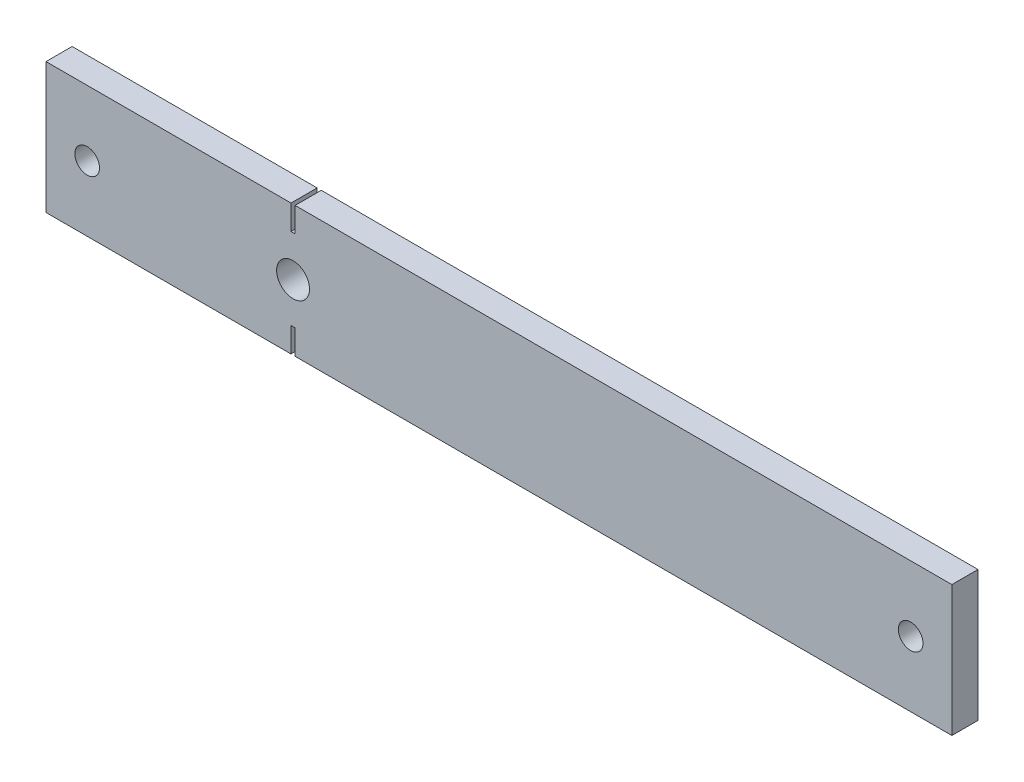
ISO-10303-21;
HEADER;
FILE_DESCRIPTION(('STEP AP214'),'2;1');
FILE_NAME('part.step','',(''),(''),'','','');
FILE_SCHEMA(('AUTOMOTIVE_DESIGN { 1 0 10303 214 1 1 1 1 }'));
ENDSEC;
DATA;
#1=APPLICATION_CONTEXT('core data for automotive mechanical design processes');
#2=APPLICATION_PROTOCOL_DEFINITION('international standard','automotive_design',2000,#1);
#3=PRODUCT_CONTEXT('',#1,'mechanical');
#4=PRODUCT('Part','Part','',(#3));
#5=PRODUCT_RELATED_PRODUCT_CATEGORY('part','',(#4));
#6=PRODUCT_DEFINITION_FORMATION('','',#4);
#7=PRODUCT_DEFINITION_CONTEXT('part definition',#1,'design');
#8=PRODUCT_DEFINITION('design','',#6,#7);
#9=PRODUCT_DEFINITION_SHAPE('','',#8);
#10=(LENGTH_UNIT() NAMED_UNIT(*) SI_UNIT(.MILLI.,.METRE.));
#11=(NAMED_UNIT(*) PLANE_ANGLE_UNIT() SI_UNIT($,.RADIAN.));
#12=(NAMED_UNIT(*) SI_UNIT($,.STERADIAN.) SOLID_ANGLE_UNIT());
#13=UNCERTAINTY_MEASURE_WITH_UNIT(LENGTH_MEASURE(1.E-05),#10,'distance_accuracy_value','');
#14=(GEOMETRIC_REPRESENTATION_CONTEXT(3) GLOBAL_UNCERTAINTY_ASSIGNED_CONTEXT((#13)) GLOBAL_UNIT_ASSIGNED_CONTEXT((#10,
#11,#12)) REPRESENTATION_CONTEXT('',''));
#15=CARTESIAN_POINT('',(0.,0.,0.));
#16=DIRECTION('',(0.,0.,1.));
#17=DIRECTION('',(1.,0.,0.));
#18=AXIS2_PLACEMENT_3D('',#15,#16,#17);
#19=CARTESIAN_POINT('',(0.,0.,6.35));
#20=DIRECTION('',(0.,0.,-1.));
#21=DIRECTION('',(-1.,0.,0.));
#22=AXIS2_PLACEMENT_3D('',#19,#20,#21);
#23=PLANE('',#22);
#24=DIRECTION('',(0.,-1.,0.));
#25=VECTOR('',#24,1.);
#26=CARTESIAN_POINT('',(0.,0.,6.35));
#27=LINE('',#26,#25);
#28=CARTESIAN_POINT('',(0.,31.75,6.35));
#29=VERTEX_POINT('',#28);
#30=CARTESIAN_POINT('',(0.,0.,6.35));
#31=VERTEX_POINT('',#30);
#32=EDGE_CURVE('E180',#29,#31,#27,.T.);
#33=ORIENTED_EDGE('',*,*,#32,.T.);
#34=DIRECTION('',(1.,0.,0.));
#35=VECTOR('',#34,1.);
#36=CARTESIAN_POINT('',(0.,0.,6.35));
#37=LINE('',#36,#35);
#38=CARTESIAN_POINT('',(59.5,0.,6.35));
#39=VERTEX_POINT('',#38);
#40=EDGE_CURVE('E108',#31,#39,#37,.T.);
#41=ORIENTED_EDGE('',*,*,#40,.T.);
#42=DIRECTION('',(0.,1.,0.));
#43=VECTOR('',#42,1.);
#44=CARTESIAN_POINT('',(59.5,0.,6.35));
#45=LINE('',#44,#43);
#46=CARTESIAN_POINT('',(59.5,6.,6.35));
#47=VERTEX_POINT('',#46);
#48=EDGE_CURVE('E207',#39,#47,#45,.T.);
#49=ORIENTED_EDGE('',*,*,#48,.T.);
#50=DIRECTION('',(1.,0.,0.));
#51=VECTOR('',#50,1.);
#52=CARTESIAN_POINT('',(59.5,6.,6.35));
#53=LINE('',#52,#51);
#54=CARTESIAN_POINT('',(60.5,6.,6.35));
#55=VERTEX_POINT('',#54);
#56=EDGE_CURVE('E226',#47,#55,#53,.T.);
#57=ORIENTED_EDGE('',*,*,#56,.T.);
#58=DIRECTION('',(0.,-1.,0.));
#59=VECTOR('',#58,1.);
#60=CARTESIAN_POINT('',(60.5,0.,6.35));
#61=LINE('',#60,#59);
#62=CARTESIAN_POINT('',(60.5,0.,6.35));
#63=VERTEX_POINT('',#62);
#64=EDGE_CURVE('E223',#55,#63,#61,.T.);
#65=ORIENTED_EDGE('',*,*,#64,.T.);
#66=DIRECTION('',(1.,0.,0.));
#67=VECTOR('',#66,1.);
#68=CARTESIAN_POINT('',(60.5,0.,6.35));
#69=LINE('',#68,#67);
#70=CARTESIAN_POINT('',(220.,0.,6.35));
#71=VERTEX_POINT('',#70);
#72=EDGE_CURVE('E225',#63,#71,#69,.T.);
#73=ORIENTED_EDGE('',*,*,#72,.T.);
#74=DIRECTION('',(0.,1.,0.));
#75=VECTOR('',#74,1.);
#76=CARTESIAN_POINT('',(220.,0.,6.35));
#77=LINE('',#76,#75);
#78=CARTESIAN_POINT('',(220.,31.75,6.35));
#79=VERTEX_POINT('',#78);
#80=EDGE_CURVE('E228',#71,#79,#77,.T.);
#81=ORIENTED_EDGE('',*,*,#80,.T.);
#82=DIRECTION('',(-1.,0.,0.));
#83=VECTOR('',#82,1.);
#84=CARTESIAN_POINT('',(60.5,31.75,6.35));
#85=LINE('',#84,#83);
#86=CARTESIAN_POINT('',(60.5,31.75,6.35));
#87=VERTEX_POINT('',#86);
#88=EDGE_CURVE('E234',#79,#87,#85,.T.);
#89=ORIENTED_EDGE('',*,*,#88,.T.);
#90=DIRECTION('',(0.,-1.,0.));
#91=VECTOR('',#90,1.);
#92=CARTESIAN_POINT('',(60.5,31.75,6.35));
#93=LINE('',#92,#91);
#94=CARTESIAN_POINT('',(60.5,25.75,6.35));
#95=VERTEX_POINT('',#94);
#96=EDGE_CURVE('E139',#87,#95,#93,.T.);
#97=ORIENTED_EDGE('',*,*,#96,.T.);
#98=DIRECTION('',(-1.,0.,0.));
#99=VECTOR('',#98,1.);
#100=CARTESIAN_POINT('',(59.5,25.75,6.35));
#101=LINE('',#100,#99);
#102=CARTESIAN_POINT('',(59.5,25.75,6.35));
#103=VERTEX_POINT('',#102);
#104=EDGE_CURVE('E133',#95,#103,#101,.T.);
#105=ORIENTED_EDGE('',*,*,#104,.T.);
#106=DIRECTION('',(0.,1.,0.));
#107=VECTOR('',#106,1.);
#108=CARTESIAN_POINT('',(59.5,31.75,6.35));
#109=LINE('',#108,#107);
#110=CARTESIAN_POINT('',(59.5,31.75,6.35));
#111=VERTEX_POINT('',#110);
#112=EDGE_CURVE('E137',#103,#111,#109,.T.);
#113=ORIENTED_EDGE('',*,*,#112,.T.);
#114=DIRECTION('',(-1.,0.,0.));
#115=VECTOR('',#114,1.);
#116=CARTESIAN_POINT('',(0.,31.75,6.35));
#117=LINE('',#116,#115);
#118=EDGE_CURVE('E53',#111,#29,#117,.T.);
#119=ORIENTED_EDGE('',*,*,#118,.T.);
#120=EDGE_LOOP('',(#33,#41,#49,#57,#65,#73,#81,#89,#97,#105,#113,#119));
#121=FACE_BOUND('',#120,.T.);
#122=CARTESIAN_POINT('',(10.,15.875,6.35));
#123=DIRECTION('',(0.,0.,1.));
#124=DIRECTION('',(1.,0.,0.));
#125=AXIS2_PLACEMENT_3D('',#122,#123,#124);
#126=CIRCLE('',#125,3.);
#127=CARTESIAN_POINT('',(13.,15.875,6.35));
#128=VERTEX_POINT('',#127);
#129=EDGE_CURVE('E161',#128,#128,#126,.T.);
#130=ORIENTED_EDGE('',*,*,#129,.F.);
#131=EDGE_LOOP('',(#130));
#132=FACE_BOUND('',#131,.T.);
#133=CARTESIAN_POINT('',(60.,15.875,6.35));
#134=DIRECTION('',(0.,0.,1.));
#135=DIRECTION('',(1.,0.,0.));
#136=AXIS2_PLACEMENT_3D('',#133,#134,#135);
#137=CIRCLE('',#136,4.00000000000001);
#138=CARTESIAN_POINT('',(64.,15.875,6.35));
#139=VERTEX_POINT('',#138);
#140=EDGE_CURVE('E288',#139,#139,#137,.T.);
#141=ORIENTED_EDGE('',*,*,#140,.F.);
#142=EDGE_LOOP('',(#141));
#143=FACE_BOUND('',#142,.T.);
#144=CARTESIAN_POINT('',(210.,15.875,6.35));
#145=DIRECTION('',(0.,0.,1.));
#146=DIRECTION('',(1.,0.,0.));
#147=AXIS2_PLACEMENT_3D('',#144,#145,#146);
#148=CIRCLE('',#147,2.99999999999999);
#149=CARTESIAN_POINT('',(213.,15.875,6.35));
#150=VERTEX_POINT('',#149);
#151=EDGE_CURVE('E279',#150,#150,#148,.T.);
#152=ORIENTED_EDGE('',*,*,#151,.F.);
#153=EDGE_LOOP('',(#152));
#154=FACE_BOUND('',#153,.T.);
#155=ADVANCED_FACE('F36',(#121,#132,#143,#154),#23,.F.);
#156=CARTESIAN_POINT('',(0.,0.,0.));
#157=DIRECTION('',(0.,0.,-1.));
#158=DIRECTION('',(-1.,0.,0.));
#159=AXIS2_PLACEMENT_3D('',#156,#157,#158);
#160=PLANE('',#159);
#161=CARTESIAN_POINT('',(60.,15.875,0.));
#162=DIRECTION('',(0.,0.,1.));
#163=DIRECTION('',(1.,0.,0.));
#164=AXIS2_PLACEMENT_3D('',#161,#162,#163);
#165=CIRCLE('',#164,4.00000000000001);
#166=CARTESIAN_POINT('',(64.,15.875,0.));
#167=VERTEX_POINT('',#166);
#168=EDGE_CURVE('E285',#167,#167,#165,.T.);
#169=ORIENTED_EDGE('',*,*,#168,.T.);
#170=EDGE_LOOP('',(#169));
#171=FACE_BOUND('',#170,.T.);
#172=DIRECTION('',(0.,-1.,0.));
#173=VECTOR('',#172,1.);
#174=CARTESIAN_POINT('',(0.,0.,0.));
#175=LINE('',#174,#173);
#176=CARTESIAN_POINT('',(0.,31.75,0.));
#177=VERTEX_POINT('',#176);
#178=CARTESIAN_POINT('',(0.,0.,0.));
#179=VERTEX_POINT('',#178);
#180=EDGE_CURVE('E157',#177,#179,#175,.T.);
#181=ORIENTED_EDGE('',*,*,#180,.F.);
#182=DIRECTION('',(-1.,0.,0.));
#183=VECTOR('',#182,1.);
#184=CARTESIAN_POINT('',(0.,31.75,0.));
#185=LINE('',#184,#183);
#186=CARTESIAN_POINT('',(59.5,31.75,0.));
#187=VERTEX_POINT('',#186);
#188=EDGE_CURVE('E100',#187,#177,#185,.T.);
#189=ORIENTED_EDGE('',*,*,#188,.F.);
#190=DIRECTION('',(0.,1.,0.));
#191=VECTOR('',#190,1.);
#192=CARTESIAN_POINT('',(59.5,31.75,0.));
#193=LINE('',#192,#191);
#194=CARTESIAN_POINT('',(59.5,25.75,0.));
#195=VERTEX_POINT('',#194);
#196=EDGE_CURVE('E94',#195,#187,#193,.T.);
#197=ORIENTED_EDGE('',*,*,#196,.F.);
#198=DIRECTION('',(-1.,0.,0.));
#199=VECTOR('',#198,1.);
#200=CARTESIAN_POINT('',(59.5,25.75,0.));
#201=LINE('',#200,#199);
#202=CARTESIAN_POINT('',(60.5,25.75,0.));
#203=VERTEX_POINT('',#202);
#204=EDGE_CURVE('E147',#203,#195,#201,.T.);
#205=ORIENTED_EDGE('',*,*,#204,.F.);
#206=DIRECTION('',(0.,-1.,0.));
#207=VECTOR('',#206,1.);
#208=CARTESIAN_POINT('',(60.5,31.75,0.));
#209=LINE('',#208,#207);
#210=CARTESIAN_POINT('',(60.5,31.75,0.));
#211=VERTEX_POINT('',#210);
#212=EDGE_CURVE('E175',#211,#203,#209,.T.);
#213=ORIENTED_EDGE('',*,*,#212,.F.);
#214=DIRECTION('',(-1.,0.,0.));
#215=VECTOR('',#214,1.);
#216=CARTESIAN_POINT('',(60.5,31.75,0.));
#217=LINE('',#216,#215);
#218=CARTESIAN_POINT('',(220.,31.75,0.));
#219=VERTEX_POINT('',#218);
#220=EDGE_CURVE('E173',#219,#211,#217,.T.);
#221=ORIENTED_EDGE('',*,*,#220,.F.);
#222=DIRECTION('',(0.,1.,0.));
#223=VECTOR('',#222,1.);
#224=CARTESIAN_POINT('',(220.,0.,0.));
#225=LINE('',#224,#223);
#226=CARTESIAN_POINT('',(220.,0.,0.));
#227=VERTEX_POINT('',#226);
#228=EDGE_CURVE('E171',#227,#219,#225,.T.);
#229=ORIENTED_EDGE('',*,*,#228,.F.);
#230=DIRECTION('',(1.,0.,0.));
#231=VECTOR('',#230,1.);
#232=CARTESIAN_POINT('',(60.5,0.,0.));
#233=LINE('',#232,#231);
#234=CARTESIAN_POINT('',(60.5,0.,0.));
#235=VERTEX_POINT('',#234);
#236=EDGE_CURVE('E169',#235,#227,#233,.T.);
#237=ORIENTED_EDGE('',*,*,#236,.F.);
#238=DIRECTION('',(0.,-1.,0.));
#239=VECTOR('',#238,1.);
#240=CARTESIAN_POINT('',(60.5,0.,0.));
#241=LINE('',#240,#239);
#242=CARTESIAN_POINT('',(60.5,6.,0.));
#243=VERTEX_POINT('',#242);
#244=EDGE_CURVE('E167',#243,#235,#241,.T.);
#245=ORIENTED_EDGE('',*,*,#244,.F.);
#246=DIRECTION('',(1.,0.,0.));
#247=VECTOR('',#246,1.);
#248=CARTESIAN_POINT('',(59.5,6.,0.));
#249=LINE('',#248,#247);
#250=CARTESIAN_POINT('',(59.5,6.,0.));
#251=VERTEX_POINT('',#250);
#252=EDGE_CURVE('E165',#251,#243,#249,.T.);
#253=ORIENTED_EDGE('',*,*,#252,.F.);
#254=DIRECTION('',(0.,1.,0.));
#255=VECTOR('',#254,1.);
#256=CARTESIAN_POINT('',(59.5,0.,0.));
#257=LINE('',#256,#255);
#258=CARTESIAN_POINT('',(59.5,0.,0.));
#259=VERTEX_POINT('',#258);
#260=EDGE_CURVE('E163',#259,#251,#257,.T.);
#261=ORIENTED_EDGE('',*,*,#260,.F.);
#262=DIRECTION('',(1.,0.,0.));
#263=VECTOR('',#262,1.);
#264=CARTESIAN_POINT('',(0.,0.,0.));
#265=LINE('',#264,#263);
#266=EDGE_CURVE('E160',#179,#259,#265,.T.);
#267=ORIENTED_EDGE('',*,*,#266,.F.);
#268=EDGE_LOOP('',(#181,#189,#197,#205,#213,#221,#229,#237,#245,#253,#261,#267));
#269=FACE_BOUND('',#268,.T.);
#270=CARTESIAN_POINT('',(10.,15.875,0.));
#271=DIRECTION('',(0.,0.,1.));
#272=DIRECTION('',(1.,0.,0.));
#273=AXIS2_PLACEMENT_3D('',#270,#271,#272);
#274=CIRCLE('',#273,3.);
#275=CARTESIAN_POINT('',(13.,15.875,0.));
#276=VERTEX_POINT('',#275);
#277=EDGE_CURVE('E291',#276,#276,#274,.T.);
#278=ORIENTED_EDGE('',*,*,#277,.T.);
#279=EDGE_LOOP('',(#278));
#280=FACE_BOUND('',#279,.T.);
#281=CARTESIAN_POINT('',(210.,15.875,0.));
#282=DIRECTION('',(0.,0.,1.));
#283=DIRECTION('',(1.,0.,0.));
#284=AXIS2_PLACEMENT_3D('',#281,#282,#283);
#285=CIRCLE('',#284,2.99999999999999);
#286=CARTESIAN_POINT('',(213.,15.875,0.));
#287=VERTEX_POINT('',#286);
#288=EDGE_CURVE('E282',#287,#287,#285,.T.);
#289=ORIENTED_EDGE('',*,*,#288,.T.);
#290=EDGE_LOOP('',(#289));
#291=FACE_BOUND('',#290,.T.);
#292=ADVANCED_FACE('F211',(#171,#269,#280,#291),#160,.T.);
#293=CARTESIAN_POINT('',(0.,0.,6.35));
#294=DIRECTION('',(1.,0.,0.));
#295=DIRECTION('',(0.,0.,-1.));
#296=AXIS2_PLACEMENT_3D('',#293,#294,#295);
#297=PLANE('',#296);
#298=ORIENTED_EDGE('',*,*,#180,.T.);
#299=DIRECTION('',(0.,0.,-1.));
#300=VECTOR('',#299,1.);
#301=CARTESIAN_POINT('',(0.,0.,6.35));
#302=LINE('',#301,#300);
#303=EDGE_CURVE('E11',#31,#179,#302,.T.);
#304=ORIENTED_EDGE('',*,*,#303,.F.);
#305=ORIENTED_EDGE('',*,*,#32,.F.);
#306=DIRECTION('',(0.,0.,-1.));
#307=VECTOR('',#306,1.);
#308=CARTESIAN_POINT('',(0.,31.75,6.35));
#309=LINE('',#308,#307);
#310=EDGE_CURVE('E153',#29,#177,#309,.T.);
#311=ORIENTED_EDGE('',*,*,#310,.T.);
#312=EDGE_LOOP('',(#298,#304,#305,#311));
#313=FACE_BOUND('',#312,.T.);
#314=ADVANCED_FACE('F38',(#313),#297,.F.);
#315=CARTESIAN_POINT('',(0.,0.,6.35));
#316=DIRECTION('',(0.,1.,0.));
#317=DIRECTION('',(0.,0.,1.));
#318=AXIS2_PLACEMENT_3D('',#315,#316,#317);
#319=PLANE('',#318);
#320=ORIENTED_EDGE('',*,*,#266,.T.);
#321=DIRECTION('',(0.,0.,-1.));
#322=VECTOR('',#321,1.);
#323=CARTESIAN_POINT('',(59.5,0.,6.35));
#324=LINE('',#323,#322);
#325=EDGE_CURVE('E45',#39,#259,#324,.T.);
#326=ORIENTED_EDGE('',*,*,#325,.F.);
#327=ORIENTED_EDGE('',*,*,#40,.F.);
#328=ORIENTED_EDGE('',*,*,#303,.T.);
#329=EDGE_LOOP('',(#320,#326,#327,#328));
#330=FACE_BOUND('',#329,.T.);
#331=ADVANCED_FACE('F394',(#330),#319,.F.);
#332=CARTESIAN_POINT('',(59.5,0.,6.35));
#333=DIRECTION('',(-1.,0.,0.));
#334=DIRECTION('',(0.,0.,1.));
#335=AXIS2_PLACEMENT_3D('',#332,#333,#334);
#336=PLANE('',#335);
#337=ORIENTED_EDGE('',*,*,#260,.T.);
#338=DIRECTION('',(0.,0.,-1.));
#339=VECTOR('',#338,1.);
#340=CARTESIAN_POINT('',(59.5,6.,6.35));
#341=LINE('',#340,#339);
#342=EDGE_CURVE('E199',#47,#251,#341,.T.);
#343=ORIENTED_EDGE('',*,*,#342,.F.);
#344=ORIENTED_EDGE('',*,*,#48,.F.);
#345=ORIENTED_EDGE('',*,*,#325,.T.);
#346=EDGE_LOOP('',(#337,#343,#344,#345));
#347=FACE_BOUND('',#346,.T.);
#348=ADVANCED_FACE('F205',(#347),#336,.F.);
#349=CARTESIAN_POINT('',(59.5,6.,6.35));
#350=DIRECTION('',(0.,1.,0.));
#351=DIRECTION('',(0.,0.,1.));
#352=AXIS2_PLACEMENT_3D('',#349,#350,#351);
#353=PLANE('',#352);
#354=ORIENTED_EDGE('',*,*,#252,.T.);
#355=DIRECTION('',(0.,0.,-1.));
#356=VECTOR('',#355,1.);
#357=CARTESIAN_POINT('',(60.5,6.,6.35));
#358=LINE('',#357,#356);
#359=EDGE_CURVE('E196',#55,#243,#358,.T.);
#360=ORIENTED_EDGE('',*,*,#359,.F.);
#361=ORIENTED_EDGE('',*,*,#56,.F.);
#362=ORIENTED_EDGE('',*,*,#342,.T.);
#363=EDGE_LOOP('',(#354,#360,#361,#362));
#364=FACE_BOUND('',#363,.T.);
#365=ADVANCED_FACE('F217',(#364),#353,.F.);
#366=CARTESIAN_POINT('',(60.5,0.,6.35));
#367=DIRECTION('',(1.,0.,0.));
#368=DIRECTION('',(0.,0.,-1.));
#369=AXIS2_PLACEMENT_3D('',#366,#367,#368);
#370=PLANE('',#369);
#371=ORIENTED_EDGE('',*,*,#244,.T.);
#372=DIRECTION('',(0.,0.,-1.));
#373=VECTOR('',#372,1.);
#374=CARTESIAN_POINT('',(60.5,0.,6.35));
#375=LINE('',#374,#373);
#376=EDGE_CURVE('E193',#63,#235,#375,.T.);
#377=ORIENTED_EDGE('',*,*,#376,.F.);
#378=ORIENTED_EDGE('',*,*,#64,.F.);
#379=ORIENTED_EDGE('',*,*,#359,.T.);
#380=EDGE_LOOP('',(#371,#377,#378,#379));
#381=FACE_BOUND('',#380,.T.);
#382=ADVANCED_FACE('F221',(#381),#370,.F.);
#383=CARTESIAN_POINT('',(60.5,0.,6.35));
#384=DIRECTION('',(0.,1.,0.));
#385=DIRECTION('',(0.,0.,1.));
#386=AXIS2_PLACEMENT_3D('',#383,#384,#385);
#387=PLANE('',#386);
#388=ORIENTED_EDGE('',*,*,#236,.T.);
#389=DIRECTION('',(0.,0.,-1.));
#390=VECTOR('',#389,1.);
#391=CARTESIAN_POINT('',(220.,0.,6.35));
#392=LINE('',#391,#390);
#393=EDGE_CURVE('E190',#71,#227,#392,.T.);
#394=ORIENTED_EDGE('',*,*,#393,.F.);
#395=ORIENTED_EDGE('',*,*,#72,.F.);
#396=ORIENTED_EDGE('',*,*,#376,.T.);
#397=EDGE_LOOP('',(#388,#394,#395,#396));
#398=FACE_BOUND('',#397,.T.);
#399=ADVANCED_FACE('F359',(#398),#387,.F.);
#400=CARTESIAN_POINT('',(220.,0.,6.35));
#401=DIRECTION('',(-1.,0.,0.));
#402=DIRECTION('',(0.,0.,1.));
#403=AXIS2_PLACEMENT_3D('',#400,#401,#402);
#404=PLANE('',#403);
#405=ORIENTED_EDGE('',*,*,#228,.T.);
#406=DIRECTION('',(0.,0.,-1.));
#407=VECTOR('',#406,1.);
#408=CARTESIAN_POINT('',(220.,31.75,6.35));
#409=LINE('',#408,#407);
#410=EDGE_CURVE('E187',#79,#219,#409,.T.);
#411=ORIENTED_EDGE('',*,*,#410,.F.);
#412=ORIENTED_EDGE('',*,*,#80,.F.);
#413=ORIENTED_EDGE('',*,*,#393,.T.);
#414=EDGE_LOOP('',(#405,#411,#412,#413));
#415=FACE_BOUND('',#414,.T.);
#416=ADVANCED_FACE('F350',(#415),#404,.F.);
#417=CARTESIAN_POINT('',(60.5,31.75,6.35));
#418=DIRECTION('',(0.,-1.,0.));
#419=DIRECTION('',(0.,0.,-1.));
#420=AXIS2_PLACEMENT_3D('',#417,#418,#419);
#421=PLANE('',#420);
#422=ORIENTED_EDGE('',*,*,#220,.T.);
#423=DIRECTION('',(0.,0.,-1.));
#424=VECTOR('',#423,1.);
#425=CARTESIAN_POINT('',(60.5,31.75,6.35));
#426=LINE('',#425,#424);
#427=EDGE_CURVE('E184',#87,#211,#426,.T.);
#428=ORIENTED_EDGE('',*,*,#427,.F.);
#429=ORIENTED_EDGE('',*,*,#88,.F.);
#430=ORIENTED_EDGE('',*,*,#410,.T.);
#431=EDGE_LOOP('',(#422,#428,#429,#430));
#432=FACE_BOUND('',#431,.T.);
#433=ADVANCED_FACE('F240',(#432),#421,.F.);
#434=CARTESIAN_POINT('',(60.5,31.75,6.35));
#435=DIRECTION('',(1.,0.,0.));
#436=DIRECTION('',(0.,1.,0.));
#437=AXIS2_PLACEMENT_3D('',#434,#435,#436);
#438=PLANE('',#437);
#439=ORIENTED_EDGE('',*,*,#212,.T.);
#440=DIRECTION('',(0.,0.,-1.));
#441=VECTOR('',#440,1.);
#442=CARTESIAN_POINT('',(60.5,25.75,6.35));
#443=LINE('',#442,#441);
#444=EDGE_CURVE('E148',#95,#203,#443,.T.);
#445=ORIENTED_EDGE('',*,*,#444,.F.);
#446=ORIENTED_EDGE('',*,*,#96,.F.);
#447=ORIENTED_EDGE('',*,*,#427,.T.);
#448=EDGE_LOOP('',(#439,#445,#446,#447));
#449=FACE_BOUND('',#448,.T.);
#450=ADVANCED_FACE('F244',(#449),#438,.F.);
#451=CARTESIAN_POINT('',(59.5,25.75,6.35));
#452=DIRECTION('',(0.,-1.,0.));
#453=DIRECTION('',(0.,0.,-1.));
#454=AXIS2_PLACEMENT_3D('',#451,#452,#453);
#455=PLANE('',#454);
#456=ORIENTED_EDGE('',*,*,#204,.T.);
#457=DIRECTION('',(0.,0.,-1.));
#458=VECTOR('',#457,1.);
#459=CARTESIAN_POINT('',(59.5,25.75,6.35));
#460=LINE('',#459,#458);
#461=EDGE_CURVE('E144',#103,#195,#460,.T.);
#462=ORIENTED_EDGE('',*,*,#461,.F.);
#463=ORIENTED_EDGE('',*,*,#104,.F.);
#464=ORIENTED_EDGE('',*,*,#444,.T.);
#465=EDGE_LOOP('',(#456,#462,#463,#464));
#466=FACE_BOUND('',#465,.T.);
#467=ADVANCED_FACE('F145',(#466),#455,.F.);
#468=CARTESIAN_POINT('',(59.5,31.75,6.35));
#469=DIRECTION('',(-1.,0.,0.));
#470=DIRECTION('',(0.,-1.,0.));
#471=AXIS2_PLACEMENT_3D('',#468,#469,#470);
#472=PLANE('',#471);
#473=ORIENTED_EDGE('',*,*,#196,.T.);
#474=DIRECTION('',(0.,0.,-1.));
#475=VECTOR('',#474,1.);
#476=CARTESIAN_POINT('',(59.5,31.75,6.35));
#477=LINE('',#476,#475);
#478=EDGE_CURVE('E149',#111,#187,#477,.T.);
#479=ORIENTED_EDGE('',*,*,#478,.F.);
#480=ORIENTED_EDGE('',*,*,#112,.F.);
#481=ORIENTED_EDGE('',*,*,#461,.T.);
#482=EDGE_LOOP('',(#473,#479,#480,#481));
#483=FACE_BOUND('',#482,.T.);
#484=ADVANCED_FACE('F151',(#483),#472,.F.);
#485=CARTESIAN_POINT('',(0.,31.75,6.35));
#486=DIRECTION('',(0.,-1.,0.));
#487=DIRECTION('',(0.,0.,-1.));
#488=AXIS2_PLACEMENT_3D('',#485,#486,#487);
#489=PLANE('',#488);
#490=ORIENTED_EDGE('',*,*,#188,.T.);
#491=ORIENTED_EDGE('',*,*,#310,.F.);
#492=ORIENTED_EDGE('',*,*,#118,.F.);
#493=ORIENTED_EDGE('',*,*,#478,.T.);
#494=EDGE_LOOP('',(#490,#491,#492,#493));
#495=FACE_BOUND('',#494,.T.);
#496=ADVANCED_FACE('F248',(#495),#489,.F.);
#497=CARTESIAN_POINT('',(10.,15.875,6.35));
#498=DIRECTION('',(0.,0.,-1.));
#499=DIRECTION('',(-1.,0.,0.));
#500=AXIS2_PLACEMENT_3D('',#497,#498,#499);
#501=CYLINDRICAL_SURFACE('',#500,3.);
#502=ORIENTED_EDGE('',*,*,#129,.T.);
#503=EDGE_LOOP('',(#502));
#504=FACE_BOUND('',#503,.T.);
#505=ORIENTED_EDGE('',*,*,#277,.F.);
#506=EDGE_LOOP('',(#505));
#507=FACE_BOUND('',#506,.T.);
#508=ADVANCED_FACE('F250',(#504,#507),#501,.F.);
#509=CARTESIAN_POINT('',(60.,15.875,6.35));
#510=DIRECTION('',(0.,0.,-1.));
#511=DIRECTION('',(-1.,0.,0.));
#512=AXIS2_PLACEMENT_3D('',#509,#510,#511);
#513=CYLINDRICAL_SURFACE('',#512,4.00000000000001);
#514=ORIENTED_EDGE('',*,*,#140,.T.);
#515=EDGE_LOOP('',(#514));
#516=FACE_BOUND('',#515,.T.);
#517=ORIENTED_EDGE('',*,*,#168,.F.);
#518=EDGE_LOOP('',(#517));
#519=FACE_BOUND('',#518,.T.);
#520=ADVANCED_FACE('F256',(#516,#519),#513,.F.);
#521=CARTESIAN_POINT('',(210.,15.875,6.35));
#522=DIRECTION('',(0.,0.,-1.));
#523=DIRECTION('',(-1.,0.,0.));
#524=AXIS2_PLACEMENT_3D('',#521,#522,#523);
#525=CYLINDRICAL_SURFACE('',#524,2.99999999999999);
#526=ORIENTED_EDGE('',*,*,#151,.T.);
#527=EDGE_LOOP('',(#526));
#528=FACE_BOUND('',#527,.T.);
#529=ORIENTED_EDGE('',*,*,#288,.F.);
#530=EDGE_LOOP('',(#529));
#531=FACE_BOUND('',#530,.T.);
#532=ADVANCED_FACE('F270',(#528,#531),#525,.F.);
#533=CLOSED_SHELL('',(#155,#292,#314,#331,#348,#365,#382,#399,#416,#433,#450,#467,#484,#496,
#508,#520,#532));
#534=MANIFOLD_SOLID_BREP('B2',#533);
#535=ADVANCED_BREP_SHAPE_REPRESENTATION('',(#18,#534),#14);
#536=SHAPE_DEFINITION_REPRESENTATION(#9,#535);
ENDSEC;
END-ISO-10303-21;
